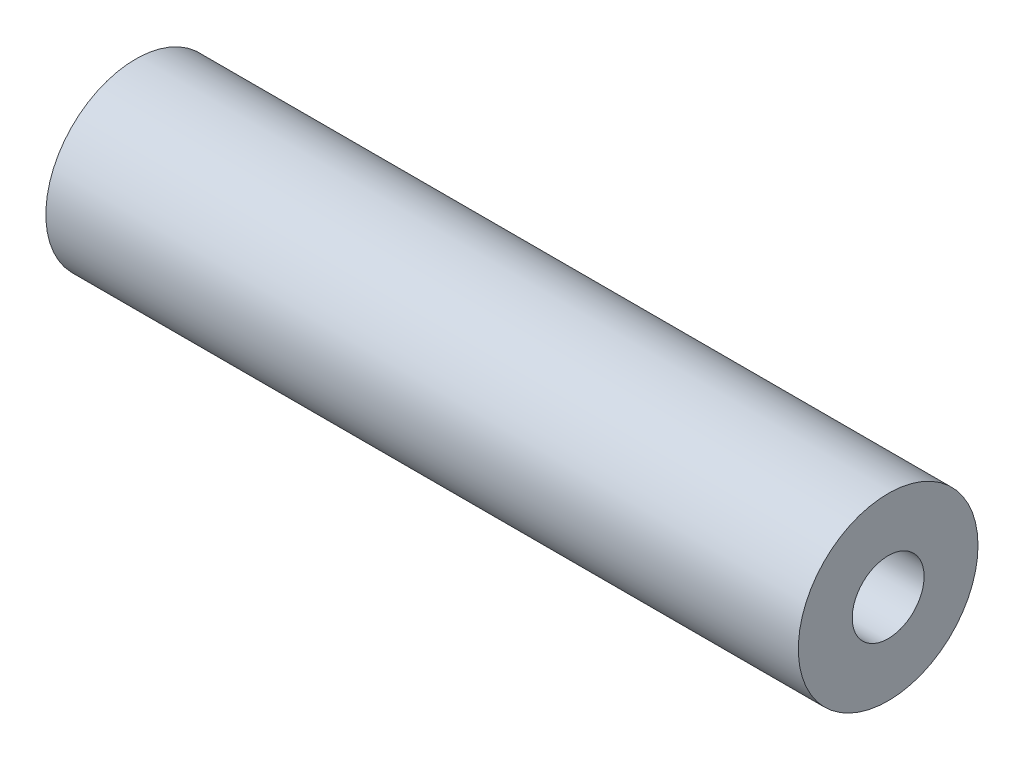
ISO-10303-21;
HEADER;
FILE_DESCRIPTION(('STEP AP214'),'2;1');
FILE_NAME('part.step','',(''),(''),'','','');
FILE_SCHEMA(('AUTOMOTIVE_DESIGN { 1 0 10303 214 1 1 1 1 }'));
ENDSEC;
DATA;
#1=APPLICATION_CONTEXT('core data for automotive mechanical design processes');
#2=APPLICATION_PROTOCOL_DEFINITION('international standard','automotive_design',2000,#1);
#3=PRODUCT_CONTEXT('',#1,'mechanical');
#4=PRODUCT('Part','Part','',(#3));
#5=PRODUCT_RELATED_PRODUCT_CATEGORY('part','',(#4));
#6=PRODUCT_DEFINITION_FORMATION('','',#4);
#7=PRODUCT_DEFINITION_CONTEXT('part definition',#1,'design');
#8=PRODUCT_DEFINITION('design','',#6,#7);
#9=PRODUCT_DEFINITION_SHAPE('','',#8);
#10=(LENGTH_UNIT() NAMED_UNIT(*) SI_UNIT(.MILLI.,.METRE.));
#11=(NAMED_UNIT(*) PLANE_ANGLE_UNIT() SI_UNIT($,.RADIAN.));
#12=(NAMED_UNIT(*) SI_UNIT($,.STERADIAN.) SOLID_ANGLE_UNIT());
#13=UNCERTAINTY_MEASURE_WITH_UNIT(LENGTH_MEASURE(1.E-05),#10,'distance_accuracy_value','');
#14=(GEOMETRIC_REPRESENTATION_CONTEXT(3) GLOBAL_UNCERTAINTY_ASSIGNED_CONTEXT((#13)) GLOBAL_UNIT_ASSIGNED_CONTEXT((#10,
#11,#12)) REPRESENTATION_CONTEXT('',''));
#15=CARTESIAN_POINT('',(0.,0.,0.));
#16=DIRECTION('',(0.,0.,1.));
#17=DIRECTION('',(1.,0.,0.));
#18=AXIS2_PLACEMENT_3D('',#15,#16,#17);
#19=CARTESIAN_POINT('',(33.5,0.,0.));
#20=DIRECTION('',(-1.,0.,0.));
#21=DIRECTION('',(0.,0.,1.));
#22=AXIS2_PLACEMENT_3D('',#19,#20,#21);
#23=CYLINDRICAL_SURFACE('',#22,8.);
#24=CARTESIAN_POINT('',(33.5,0.,0.));
#25=DIRECTION('',(1.,0.,0.));
#26=DIRECTION('',(0.,0.,-1.));
#27=AXIS2_PLACEMENT_3D('',#24,#25,#26);
#28=CIRCLE('',#27,8.);
#29=CARTESIAN_POINT('',(33.5,0.,-8.));
#30=VERTEX_POINT('',#29);
#31=EDGE_CURVE('E13',#30,#30,#28,.T.);
#32=ORIENTED_EDGE('',*,*,#31,.F.);
#33=EDGE_LOOP('',(#32));
#34=FACE_BOUND('',#33,.T.);
#35=CARTESIAN_POINT('',(-33.5,0.,0.));
#36=DIRECTION('',(1.,0.,0.));
#37=DIRECTION('',(0.,0.,-1.));
#38=AXIS2_PLACEMENT_3D('',#35,#36,#37);
#39=CIRCLE('',#38,8.);
#40=CARTESIAN_POINT('',(-33.5,0.,-8.));
#41=VERTEX_POINT('',#40);
#42=EDGE_CURVE('E47',#41,#41,#39,.T.);
#43=ORIENTED_EDGE('',*,*,#42,.T.);
#44=EDGE_LOOP('',(#43));
#45=FACE_BOUND('',#44,.T.);
#46=ADVANCED_FACE('F44',(#34,#45),#23,.T.);
#47=CARTESIAN_POINT('',(33.5,0.,0.));
#48=DIRECTION('',(1.,0.,0.));
#49=DIRECTION('',(0.,0.,-1.));
#50=AXIS2_PLACEMENT_3D('',#47,#48,#49);
#51=PLANE('',#50);
#52=CARTESIAN_POINT('',(33.5,0.,0.));
#53=DIRECTION('',(1.,0.,0.));
#54=DIRECTION('',(0.,0.,-1.));
#55=AXIS2_PLACEMENT_3D('',#52,#53,#54);
#56=CIRCLE('',#55,3.19999999999999);
#57=CARTESIAN_POINT('',(33.5,0.,-3.19999999999999));
#58=VERTEX_POINT('',#57);
#59=EDGE_CURVE('E68',#58,#58,#56,.T.);
#60=ORIENTED_EDGE('',*,*,#59,.F.);
#61=EDGE_LOOP('',(#60));
#62=FACE_BOUND('',#61,.T.);
#63=ORIENTED_EDGE('',*,*,#31,.T.);
#64=EDGE_LOOP('',(#63));
#65=FACE_BOUND('',#64,.T.);
#66=ADVANCED_FACE('F86',(#62,#65),#51,.T.);
#67=CARTESIAN_POINT('',(-33.5,0.,0.));
#68=DIRECTION('',(1.,0.,0.));
#69=DIRECTION('',(0.,0.,-1.));
#70=AXIS2_PLACEMENT_3D('',#67,#68,#69);
#71=PLANE('',#70);
#72=CARTESIAN_POINT('',(-33.5,0.,0.));
#73=DIRECTION('',(-1.,0.,0.));
#74=DIRECTION('',(0.,0.,1.));
#75=AXIS2_PLACEMENT_3D('',#72,#73,#74);
#76=CIRCLE('',#75,3.19999999999999);
#77=CARTESIAN_POINT('',(-33.5,0.,3.19999999999999));
#78=VERTEX_POINT('',#77);
#79=EDGE_CURVE('E67',#78,#78,#76,.T.);
#80=ORIENTED_EDGE('',*,*,#79,.F.);
#81=EDGE_LOOP('',(#80));
#82=FACE_BOUND('',#81,.T.);
#83=ORIENTED_EDGE('',*,*,#42,.F.);
#84=EDGE_LOOP('',(#83));
#85=FACE_BOUND('',#84,.T.);
#86=ADVANCED_FACE('F83',(#82,#85),#71,.F.);
#87=CARTESIAN_POINT('',(-13.5,0.,0.));
#88=DIRECTION('',(-1.,0.,0.));
#89=DIRECTION('',(0.,0.,1.));
#90=AXIS2_PLACEMENT_3D('',#87,#88,#89);
#91=CONICAL_SURFACE('',#90,3.2,1.02974425867665);
#92=CARTESIAN_POINT('',(-11.5772460191118,0.,0.));
#93=VERTEX_POINT('',#92);
#94=VERTEX_LOOP('',#93);
#95=FACE_BOUND('',#94,.T.);
#96=CARTESIAN_POINT('',(-13.5,0.,0.));
#97=DIRECTION('',(-1.,0.,0.));
#98=DIRECTION('',(0.,0.,1.));
#99=AXIS2_PLACEMENT_3D('',#96,#97,#98);
#100=CIRCLE('',#99,3.2);
#101=CARTESIAN_POINT('',(-13.5,0.,3.2));
#102=VERTEX_POINT('',#101);
#103=EDGE_CURVE('E71',#102,#102,#100,.T.);
#104=ORIENTED_EDGE('',*,*,#103,.T.);
#105=EDGE_LOOP('',(#104));
#106=FACE_BOUND('',#105,.T.);
#107=ADVANCED_FACE('F85',(#95,#106),#91,.F.);
#108=CARTESIAN_POINT('',(-33.5,0.,0.));
#109=DIRECTION('',(-1.,0.,0.));
#110=DIRECTION('',(0.,0.,1.));
#111=AXIS2_PLACEMENT_3D('',#108,#109,#110);
#112=CYLINDRICAL_SURFACE('',#111,3.19999999999999);
#113=ORIENTED_EDGE('',*,*,#103,.F.);
#114=EDGE_LOOP('',(#113));
#115=FACE_BOUND('',#114,.T.);
#116=ORIENTED_EDGE('',*,*,#79,.T.);
#117=EDGE_LOOP('',(#116));
#118=FACE_BOUND('',#117,.T.);
#119=ADVANCED_FACE('F61',(#115,#118),#112,.F.);
#120=CARTESIAN_POINT('',(13.5,0.,0.));
#121=DIRECTION('',(1.,0.,0.));
#122=DIRECTION('',(0.,0.,-1.));
#123=AXIS2_PLACEMENT_3D('',#120,#121,#122);
#124=CONICAL_SURFACE('',#123,3.19999999999999,1.02974425867665);
#125=CARTESIAN_POINT('',(11.5772460191118,0.,0.));
#126=VERTEX_POINT('',#125);
#127=VERTEX_LOOP('',#126);
#128=FACE_BOUND('',#127,.T.);
#129=CARTESIAN_POINT('',(13.5,0.,0.));
#130=DIRECTION('',(1.,0.,0.));
#131=DIRECTION('',(0.,0.,-1.));
#132=AXIS2_PLACEMENT_3D('',#129,#130,#131);
#133=CIRCLE('',#132,3.19999999999999);
#134=CARTESIAN_POINT('',(13.5,0.,-3.19999999999999));
#135=VERTEX_POINT('',#134);
#136=EDGE_CURVE('E65',#135,#135,#133,.T.);
#137=ORIENTED_EDGE('',*,*,#136,.T.);
#138=EDGE_LOOP('',(#137));
#139=FACE_BOUND('',#138,.T.);
#140=ADVANCED_FACE('F57',(#128,#139),#124,.F.);
#141=CARTESIAN_POINT('',(33.5,0.,0.));
#142=DIRECTION('',(1.,0.,0.));
#143=DIRECTION('',(0.,0.,-1.));
#144=AXIS2_PLACEMENT_3D('',#141,#142,#143);
#145=CYLINDRICAL_SURFACE('',#144,3.19999999999999);
#146=ORIENTED_EDGE('',*,*,#136,.F.);
#147=EDGE_LOOP('',(#146));
#148=FACE_BOUND('',#147,.T.);
#149=ORIENTED_EDGE('',*,*,#59,.T.);
#150=EDGE_LOOP('',(#149));
#151=FACE_BOUND('',#150,.T.);
#152=ADVANCED_FACE('F60',(#148,#151),#145,.F.);
#153=CLOSED_SHELL('',(#46,#66,#86,#107,#119,#140,#152));
#154=MANIFOLD_SOLID_BREP('B2',#153);
#155=ADVANCED_BREP_SHAPE_REPRESENTATION('',(#18,#154),#14);
#156=SHAPE_DEFINITION_REPRESENTATION(#9,#155);
ENDSEC;
END-ISO-10303-21;
